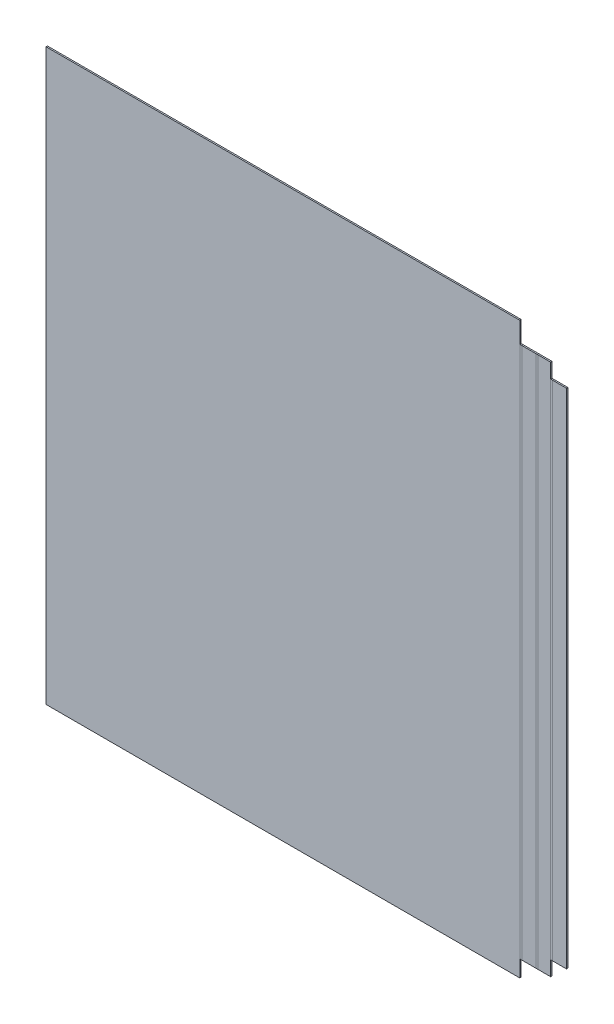
ISO-10303-21;
HEADER;
FILE_DESCRIPTION(('STEP AP214'),'2;1');
FILE_NAME('part.step','',(''),(''),'','','');
FILE_SCHEMA(('AUTOMOTIVE_DESIGN { 1 0 10303 214 1 1 1 1 }'));
ENDSEC;
DATA;
#1=APPLICATION_CONTEXT('core data for automotive mechanical design processes');
#2=APPLICATION_PROTOCOL_DEFINITION('international standard','automotive_design',2000,#1);
#3=PRODUCT_CONTEXT('',#1,'mechanical');
#4=PRODUCT('Part','Part','',(#3));
#5=PRODUCT_RELATED_PRODUCT_CATEGORY('part','',(#4));
#6=PRODUCT_DEFINITION_FORMATION('','',#4);
#7=PRODUCT_DEFINITION_CONTEXT('part definition',#1,'design');
#8=PRODUCT_DEFINITION('design','',#6,#7);
#9=PRODUCT_DEFINITION_SHAPE('','',#8);
#10=(LENGTH_UNIT() NAMED_UNIT(*) SI_UNIT(.MILLI.,.METRE.));
#11=(NAMED_UNIT(*) PLANE_ANGLE_UNIT() SI_UNIT($,.RADIAN.));
#12=(NAMED_UNIT(*) SI_UNIT($,.STERADIAN.) SOLID_ANGLE_UNIT());
#13=UNCERTAINTY_MEASURE_WITH_UNIT(LENGTH_MEASURE(1.E-05),#10,'distance_accuracy_value','');
#14=(GEOMETRIC_REPRESENTATION_CONTEXT(3) GLOBAL_UNCERTAINTY_ASSIGNED_CONTEXT((#13)) GLOBAL_UNIT_ASSIGNED_CONTEXT((#10,
#11,#12)) REPRESENTATION_CONTEXT('',''));
#15=CARTESIAN_POINT('',(0.,0.,0.));
#16=DIRECTION('',(0.,0.,1.));
#17=DIRECTION('',(1.,0.,0.));
#18=AXIS2_PLACEMENT_3D('',#15,#16,#17);
#19=CARTESIAN_POINT('',(343.802210169545,776.2,0.));
#20=DIRECTION('',(0.,0.,-1.));
#21=DIRECTION('',(-1.,0.,0.));
#22=AXIS2_PLACEMENT_3D('',#19,#20,#21);
#23=PLANE('',#22);
#24=DIRECTION('',(0.,-1.,0.));
#25=VECTOR('',#24,1.);
#26=CARTESIAN_POINT('',(363.065610169545,776.2,0.));
#27=LINE('',#26,#25);
#28=CARTESIAN_POINT('',(363.065610169545,747.8,0.));
#29=VERTEX_POINT('',#28);
#30=CARTESIAN_POINT('',(363.065610169545,22.5,0.));
#31=VERTEX_POINT('',#30);
#32=EDGE_CURVE('E392',#29,#31,#27,.T.);
#33=ORIENTED_EDGE('',*,*,#32,.T.);
#34=DIRECTION('',(-1.,0.,0.));
#35=VECTOR('',#34,1.);
#36=CARTESIAN_POINT('',(343.802210169545,22.5,0.));
#37=LINE('',#36,#35);
#38=CARTESIAN_POINT('',(346.438810169545,22.5,0.));
#39=VERTEX_POINT('',#38);
#40=EDGE_CURVE('E376',#31,#39,#37,.T.);
#41=ORIENTED_EDGE('',*,*,#40,.T.);
#42=DIRECTION('',(0.,-1.,0.));
#43=VECTOR('',#42,1.);
#44=CARTESIAN_POINT('',(346.438810169545,776.2,0.));
#45=LINE('',#44,#43);
#46=CARTESIAN_POINT('',(346.438810169545,747.8,0.));
#47=VERTEX_POINT('',#46);
#48=EDGE_CURVE('E382',#47,#39,#45,.T.);
#49=ORIENTED_EDGE('',*,*,#48,.F.);
#50=DIRECTION('',(-1.,0.,0.));
#51=VECTOR('',#50,1.);
#52=CARTESIAN_POINT('',(354.752210169545,747.8,0.));
#53=LINE('',#52,#51);
#54=EDGE_CURVE('E379',#29,#47,#53,.T.);
#55=ORIENTED_EDGE('',*,*,#54,.F.);
#56=EDGE_LOOP('',(#33,#41,#49,#55));
#57=FACE_BOUND('',#56,.T.);
#58=ADVANCED_FACE('F43',(#57),#23,.T.);
#59=CARTESIAN_POINT('',(343.802210169545,776.2,1.90000000000001));
#60=DIRECTION('',(0.,0.,-1.));
#61=DIRECTION('',(-1.,0.,0.));
#62=AXIS2_PLACEMENT_3D('',#59,#60,#61);
#63=PLANE('',#62);
#64=DIRECTION('',(1.,0.,0.));
#65=VECTOR('',#64,1.);
#66=CARTESIAN_POINT('',(354.752210169545,22.5,1.90000000000001));
#67=LINE('',#66,#65);
#68=CARTESIAN_POINT('',(363.065610169545,22.5,1.90000000000001));
#69=VERTEX_POINT('',#68);
#70=CARTESIAN_POINT('',(346.438810169545,22.5,1.90000000000001));
#71=VERTEX_POINT('',#70);
#72=EDGE_CURVE('E57',#69,#71,#67,.F.);
#73=ORIENTED_EDGE('',*,*,#72,.F.);
#74=DIRECTION('',(0.,-1.,0.));
#75=VECTOR('',#74,1.);
#76=CARTESIAN_POINT('',(363.065610169545,776.2,1.90000000000001));
#77=LINE('',#76,#75);
#78=CARTESIAN_POINT('',(363.065610169545,747.8,1.90000000000001));
#79=VERTEX_POINT('',#78);
#80=EDGE_CURVE('E50',#79,#69,#77,.T.);
#81=ORIENTED_EDGE('',*,*,#80,.F.);
#82=DIRECTION('',(-1.,0.,0.));
#83=VECTOR('',#82,1.);
#84=CARTESIAN_POINT('',(343.802210169545,747.8,1.90000000000001));
#85=LINE('',#84,#83);
#86=CARTESIAN_POINT('',(346.438810169545,747.8,1.90000000000001));
#87=VERTEX_POINT('',#86);
#88=EDGE_CURVE('E65',#79,#87,#85,.T.);
#89=ORIENTED_EDGE('',*,*,#88,.T.);
#90=DIRECTION('',(0.,-1.,0.));
#91=VECTOR('',#90,1.);
#92=CARTESIAN_POINT('',(346.438810169545,776.2,1.90000000000001));
#93=LINE('',#92,#91);
#94=EDGE_CURVE('E388',#87,#71,#93,.T.);
#95=ORIENTED_EDGE('',*,*,#94,.T.);
#96=EDGE_LOOP('',(#73,#81,#89,#95));
#97=FACE_BOUND('',#96,.T.);
#98=ADVANCED_FACE('F498',(#97),#63,.F.);
#99=CARTESIAN_POINT('',(343.802210169545,747.8,1.90000000000001));
#100=DIRECTION('',(0.,-1.,0.));
#101=DIRECTION('',(-1.,0.,0.));
#102=AXIS2_PLACEMENT_3D('',#99,#100,#101);
#103=PLANE('',#102);
#104=ORIENTED_EDGE('',*,*,#54,.T.);
#105=DIRECTION('',(0.,0.,1.));
#106=VECTOR('',#105,1.);
#107=CARTESIAN_POINT('',(346.438810169545,747.8,0.));
#108=LINE('',#107,#106);
#109=EDGE_CURVE('E390',#47,#87,#108,.T.);
#110=ORIENTED_EDGE('',*,*,#109,.T.);
#111=ORIENTED_EDGE('',*,*,#88,.F.);
#112=DIRECTION('',(0.,0.,1.));
#113=VECTOR('',#112,1.);
#114=CARTESIAN_POINT('',(363.065610169545,747.8,0.));
#115=LINE('',#114,#113);
#116=EDGE_CURVE('E394',#29,#79,#115,.T.);
#117=ORIENTED_EDGE('',*,*,#116,.F.);
#118=EDGE_LOOP('',(#104,#110,#111,#117));
#119=FACE_BOUND('',#118,.T.);
#120=ADVANCED_FACE('F429',(#119),#103,.F.);
#121=CARTESIAN_POINT('',(343.802210169545,22.5,0.));
#122=DIRECTION('',(0.,1.,0.));
#123=DIRECTION('',(-1.,0.,0.));
#124=AXIS2_PLACEMENT_3D('',#121,#122,#123);
#125=PLANE('',#124);
#126=DIRECTION('',(0.,0.,-1.));
#127=VECTOR('',#126,1.);
#128=CARTESIAN_POINT('',(363.065610169545,22.5,1.90000000000001));
#129=LINE('',#128,#127);
#130=EDGE_CURVE('E11',#69,#31,#129,.T.);
#131=ORIENTED_EDGE('',*,*,#130,.F.);
#132=ORIENTED_EDGE('',*,*,#72,.T.);
#133=DIRECTION('',(0.,0.,-1.));
#134=VECTOR('',#133,1.);
#135=CARTESIAN_POINT('',(346.438810169545,22.5,1.90000000000007));
#136=LINE('',#135,#134);
#137=EDGE_CURVE('E386',#71,#39,#136,.T.);
#138=ORIENTED_EDGE('',*,*,#137,.T.);
#139=ORIENTED_EDGE('',*,*,#40,.F.);
#140=EDGE_LOOP('',(#131,#132,#138,#139));
#141=FACE_BOUND('',#140,.T.);
#142=ADVANCED_FACE('F505',(#141),#125,.F.);
#143=CARTESIAN_POINT('',(304.7866,776.2,25.7366));
#144=DIRECTION('',(0.,-1.,0.));
#145=DIRECTION('',(-1.,0.,0.));
#146=AXIS2_PLACEMENT_3D('',#143,#144,#145);
#147=PLANE('',#146);
#148=DIRECTION('',(1.,0.,0.));
#149=VECTOR('',#148,1.);
#150=CARTESIAN_POINT('',(-324.05,776.2,1.9));
#151=LINE('',#150,#149);
#152=CARTESIAN_POINT('',(-324.05,776.2,1.9));
#153=VERTEX_POINT('',#152);
#154=CARTESIAN_POINT('',(321.4134,776.2,1.9));
#155=VERTEX_POINT('',#154);
#156=EDGE_CURVE('E365',#153,#155,#151,.T.);
#157=ORIENTED_EDGE('',*,*,#156,.T.);
#158=DIRECTION('',(0.,0.,-1.));
#159=VECTOR('',#158,1.);
#160=CARTESIAN_POINT('',(321.4134,776.2,1.9));
#161=LINE('',#160,#159);
#162=CARTESIAN_POINT('',(321.4134,776.2,0.));
#163=VERTEX_POINT('',#162);
#164=EDGE_CURVE('E362',#155,#163,#161,.T.);
#165=ORIENTED_EDGE('',*,*,#164,.T.);
#166=DIRECTION('',(1.,0.,0.));
#167=VECTOR('',#166,1.);
#168=CARTESIAN_POINT('',(-324.05,776.2,0.));
#169=LINE('',#168,#167);
#170=CARTESIAN_POINT('',(-324.05,776.2,0.));
#171=VERTEX_POINT('',#170);
#172=EDGE_CURVE('E333',#171,#163,#169,.T.);
#173=ORIENTED_EDGE('',*,*,#172,.F.);
#174=DIRECTION('',(0.,0.,-1.));
#175=VECTOR('',#174,1.);
#176=CARTESIAN_POINT('',(-324.05,776.2,1.9));
#177=LINE('',#176,#175);
#178=EDGE_CURVE('E359',#153,#171,#177,.T.);
#179=ORIENTED_EDGE('',*,*,#178,.F.);
#180=EDGE_LOOP('',(#157,#165,#173,#179));
#181=FACE_BOUND('',#180,.T.);
#182=ADVANCED_FACE('F510',(#181),#147,.F.);
#183=CARTESIAN_POINT('',(-324.05,776.2,1.9));
#184=DIRECTION('',(-1.,0.,0.));
#185=DIRECTION('',(0.,0.,1.));
#186=AXIS2_PLACEMENT_3D('',#183,#184,#185);
#187=PLANE('',#186);
#188=DIRECTION('',(0.,0.,-1.));
#189=VECTOR('',#188,1.);
#190=CARTESIAN_POINT('',(-324.05,0.,1.9));
#191=LINE('',#190,#189);
#192=CARTESIAN_POINT('',(-324.05,0.,1.9));
#193=VERTEX_POINT('',#192);
#194=CARTESIAN_POINT('',(-324.05,0.,0.));
#195=VERTEX_POINT('',#194);
#196=EDGE_CURVE('E348',#193,#195,#191,.T.);
#197=ORIENTED_EDGE('',*,*,#196,.F.);
#198=DIRECTION('',(0.,-1.,0.));
#199=VECTOR('',#198,1.);
#200=CARTESIAN_POINT('',(-324.05,776.2,1.9));
#201=LINE('',#200,#199);
#202=EDGE_CURVE('E338',#153,#193,#201,.T.);
#203=ORIENTED_EDGE('',*,*,#202,.F.);
#204=ORIENTED_EDGE('',*,*,#178,.T.);
#205=DIRECTION('',(0.,-1.,0.));
#206=VECTOR('',#205,1.);
#207=CARTESIAN_POINT('',(-324.05,776.2,0.));
#208=LINE('',#207,#206);
#209=EDGE_CURVE('E357',#171,#195,#208,.T.);
#210=ORIENTED_EDGE('',*,*,#209,.T.);
#211=EDGE_LOOP('',(#197,#203,#204,#210));
#212=FACE_BOUND('',#211,.T.);
#213=ADVANCED_FACE('F833',(#212),#187,.T.);
#214=CARTESIAN_POINT('',(322.15,0.,2.6366));
#215=DIRECTION('',(0.,-1.,0.));
#216=DIRECTION('',(0.,0.,-1.));
#217=AXIS2_PLACEMENT_3D('',#214,#215,#216);
#218=PLANE('',#217);
#219=DIRECTION('',(1.,0.,0.));
#220=VECTOR('',#219,1.);
#221=CARTESIAN_POINT('',(-324.05,0.,0.));
#222=LINE('',#221,#220);
#223=CARTESIAN_POINT('',(321.4134,0.,0.));
#224=VERTEX_POINT('',#223);
#225=EDGE_CURVE('E354',#195,#224,#222,.T.);
#226=ORIENTED_EDGE('',*,*,#225,.T.);
#227=DIRECTION('',(0.,0.,1.));
#228=VECTOR('',#227,1.);
#229=CARTESIAN_POINT('',(321.4134,0.,0.));
#230=LINE('',#229,#228);
#231=CARTESIAN_POINT('',(321.4134,0.,1.9));
#232=VERTEX_POINT('',#231);
#233=EDGE_CURVE('E351',#224,#232,#230,.T.);
#234=ORIENTED_EDGE('',*,*,#233,.T.);
#235=DIRECTION('',(1.,0.,0.));
#236=VECTOR('',#235,1.);
#237=CARTESIAN_POINT('',(-324.05,0.,1.9));
#238=LINE('',#237,#236);
#239=EDGE_CURVE('E340',#193,#232,#238,.T.);
#240=ORIENTED_EDGE('',*,*,#239,.F.);
#241=ORIENTED_EDGE('',*,*,#196,.T.);
#242=EDGE_LOOP('',(#226,#234,#240,#241));
#243=FACE_BOUND('',#242,.T.);
#244=ADVANCED_FACE('F822',(#243),#218,.T.);
#245=CARTESIAN_POINT('',(321.4134,762.,1.9));
#246=DIRECTION('',(1.,0.,0.));
#247=DIRECTION('',(0.,-1.,0.));
#248=AXIS2_PLACEMENT_3D('',#245,#246,#247);
#249=PLANE('',#248);
#250=ORIENTED_EDGE('',*,*,#164,.F.);
#251=DIRECTION('',(0.,-1.,0.));
#252=VECTOR('',#251,1.);
#253=CARTESIAN_POINT('',(321.4134,776.2,1.9));
#254=LINE('',#253,#252);
#255=CARTESIAN_POINT('',(321.4134,747.8,1.9));
#256=VERTEX_POINT('',#255);
#257=EDGE_CURVE('E346',#155,#256,#254,.T.);
#258=ORIENTED_EDGE('',*,*,#257,.T.);
#259=DIRECTION('',(0.,0.,-1.));
#260=VECTOR('',#259,1.);
#261=CARTESIAN_POINT('',(321.4134,747.8,1.9));
#262=LINE('',#261,#260);
#263=CARTESIAN_POINT('',(321.4134,747.8,0.));
#264=VERTEX_POINT('',#263);
#265=EDGE_CURVE('E343',#256,#264,#262,.T.);
#266=ORIENTED_EDGE('',*,*,#265,.T.);
#267=DIRECTION('',(0.,-1.,0.));
#268=VECTOR('',#267,1.);
#269=CARTESIAN_POINT('',(321.4134,776.2,0.));
#270=LINE('',#269,#268);
#271=EDGE_CURVE('E331',#163,#264,#270,.T.);
#272=ORIENTED_EDGE('',*,*,#271,.F.);
#273=EDGE_LOOP('',(#250,#258,#266,#272));
#274=FACE_BOUND('',#273,.T.);
#275=ADVANCED_FACE('F474',(#274),#249,.T.);
#276=CARTESIAN_POINT('',(-324.05,776.2,1.9));
#277=DIRECTION('',(0.,0.,-1.));
#278=DIRECTION('',(-1.,0.,0.));
#279=AXIS2_PLACEMENT_3D('',#276,#277,#278);
#280=PLANE('',#279);
#281=ORIENTED_EDGE('',*,*,#239,.T.);
#282=DIRECTION('',(0.,-1.,0.));
#283=VECTOR('',#282,1.);
#284=CARTESIAN_POINT('',(321.4134,776.2,1.9));
#285=LINE('',#284,#283);
#286=CARTESIAN_POINT('',(321.4134,22.5,1.9));
#287=VERTEX_POINT('',#286);
#288=EDGE_CURVE('E336',#287,#232,#285,.T.);
#289=ORIENTED_EDGE('',*,*,#288,.F.);
#290=DIRECTION('',(0.,-1.,0.));
#291=VECTOR('',#290,1.);
#292=CARTESIAN_POINT('',(321.4134,776.2,1.9));
#293=LINE('',#292,#291);
#294=EDGE_CURVE('E320',#256,#287,#293,.T.);
#295=ORIENTED_EDGE('',*,*,#294,.F.);
#296=ORIENTED_EDGE('',*,*,#257,.F.);
#297=ORIENTED_EDGE('',*,*,#156,.F.);
#298=ORIENTED_EDGE('',*,*,#202,.T.);
#299=EDGE_LOOP('',(#281,#289,#295,#296,#297,#298));
#300=FACE_BOUND('',#299,.T.);
#301=ADVANCED_FACE('F800',(#300),#280,.F.);
#302=CARTESIAN_POINT('',(321.4134,11.25,1.9));
#303=DIRECTION('',(1.,0.,0.));
#304=DIRECTION('',(0.,-1.,0.));
#305=AXIS2_PLACEMENT_3D('',#302,#303,#304);
#306=PLANE('',#305);
#307=ORIENTED_EDGE('',*,*,#288,.T.);
#308=ORIENTED_EDGE('',*,*,#233,.F.);
#309=DIRECTION('',(0.,-1.,0.));
#310=VECTOR('',#309,1.);
#311=CARTESIAN_POINT('',(321.4134,776.2,0.));
#312=LINE('',#311,#310);
#313=CARTESIAN_POINT('',(321.4134,22.5,0.));
#314=VERTEX_POINT('',#313);
#315=EDGE_CURVE('E326',#314,#224,#312,.T.);
#316=ORIENTED_EDGE('',*,*,#315,.F.);
#317=DIRECTION('',(0.,0.,-1.));
#318=VECTOR('',#317,1.);
#319=CARTESIAN_POINT('',(321.4134,22.5,1.9));
#320=LINE('',#319,#318);
#321=EDGE_CURVE('E311',#287,#314,#320,.T.);
#322=ORIENTED_EDGE('',*,*,#321,.F.);
#323=EDGE_LOOP('',(#307,#308,#316,#322));
#324=FACE_BOUND('',#323,.T.);
#325=ADVANCED_FACE('F486',(#324),#306,.T.);
#326=CARTESIAN_POINT('',(-324.05,776.2,0.));
#327=DIRECTION('',(0.,0.,-1.));
#328=DIRECTION('',(-1.,0.,0.));
#329=AXIS2_PLACEMENT_3D('',#326,#327,#328);
#330=PLANE('',#329);
#331=ORIENTED_EDGE('',*,*,#225,.F.);
#332=ORIENTED_EDGE('',*,*,#209,.F.);
#333=ORIENTED_EDGE('',*,*,#172,.T.);
#334=ORIENTED_EDGE('',*,*,#271,.T.);
#335=DIRECTION('',(0.,-1.,0.));
#336=VECTOR('',#335,1.);
#337=CARTESIAN_POINT('',(321.4134,776.2,0.));
#338=LINE('',#337,#336);
#339=EDGE_CURVE('E329',#264,#314,#338,.T.);
#340=ORIENTED_EDGE('',*,*,#339,.T.);
#341=ORIENTED_EDGE('',*,*,#315,.T.);
#342=EDGE_LOOP('',(#331,#332,#333,#334,#340,#341));
#343=FACE_BOUND('',#342,.T.);
#344=ADVANCED_FACE('F483',(#343),#330,.T.);
#345=CARTESIAN_POINT('',(321.4134,747.8,0.));
#346=DIRECTION('',(0.,1.,0.));
#347=DIRECTION('',(1.,0.,0.));
#348=AXIS2_PLACEMENT_3D('',#345,#346,#347);
#349=PLANE('',#348);
#350=DIRECTION('',(-1.,0.,0.));
#351=VECTOR('',#350,1.);
#352=CARTESIAN_POINT('',(322.738052542386,747.8,1.9));
#353=LINE('',#352,#351);
#354=CARTESIAN_POINT('',(324.062705084772,747.8,1.90000000000001));
#355=VERTEX_POINT('',#354);
#356=EDGE_CURVE('E323',#256,#355,#353,.F.);
#357=ORIENTED_EDGE('',*,*,#356,.T.);
#358=DIRECTION('',(0.,0.,1.));
#359=VECTOR('',#358,1.);
#360=CARTESIAN_POINT('',(324.062705084772,747.8,0.));
#361=LINE('',#360,#359);
#362=CARTESIAN_POINT('',(324.062705084772,747.8,0.));
#363=VERTEX_POINT('',#362);
#364=EDGE_CURVE('E285',#363,#355,#361,.T.);
#365=ORIENTED_EDGE('',*,*,#364,.F.);
#366=DIRECTION('',(1.,0.,0.));
#367=VECTOR('',#366,1.);
#368=CARTESIAN_POINT('',(321.4134,747.8,0.));
#369=LINE('',#368,#367);
#370=EDGE_CURVE('E308',#264,#363,#369,.T.);
#371=ORIENTED_EDGE('',*,*,#370,.F.);
#372=ORIENTED_EDGE('',*,*,#265,.F.);
#373=EDGE_LOOP('',(#357,#365,#371,#372));
#374=FACE_BOUND('',#373,.T.);
#375=ADVANCED_FACE('F471',(#374),#349,.T.);
#376=CARTESIAN_POINT('',(322.738052542386,385.15,1.9));
#377=DIRECTION('',(0.,0.,-1.));
#378=DIRECTION('',(-1.,0.,0.));
#379=AXIS2_PLACEMENT_3D('',#376,#377,#378);
#380=PLANE('',#379);
#381=ORIENTED_EDGE('',*,*,#294,.T.);
#382=DIRECTION('',(-1.,0.,0.));
#383=VECTOR('',#382,1.);
#384=CARTESIAN_POINT('',(322.738052542386,22.5,1.9));
#385=LINE('',#384,#383);
#386=CARTESIAN_POINT('',(324.062705084772,22.5,1.90000000000001));
#387=VERTEX_POINT('',#386);
#388=EDGE_CURVE('E314',#387,#287,#385,.T.);
#389=ORIENTED_EDGE('',*,*,#388,.F.);
#390=DIRECTION('',(0.,-1.,0.));
#391=VECTOR('',#390,1.);
#392=CARTESIAN_POINT('',(324.062705084772,776.2,1.90000000000001));
#393=LINE('',#392,#391);
#394=EDGE_CURVE('E290',#355,#387,#393,.T.);
#395=ORIENTED_EDGE('',*,*,#394,.F.);
#396=ORIENTED_EDGE('',*,*,#356,.F.);
#397=EDGE_LOOP('',(#381,#389,#395,#396));
#398=FACE_BOUND('',#397,.T.);
#399=ADVANCED_FACE('F469',(#398),#380,.F.);
#400=CARTESIAN_POINT('',(324.062705084772,22.5,0.));
#401=DIRECTION('',(0.,-1.,0.));
#402=DIRECTION('',(-1.,0.,0.));
#403=AXIS2_PLACEMENT_3D('',#400,#401,#402);
#404=PLANE('',#403);
#405=DIRECTION('',(0.,0.,1.));
#406=VECTOR('',#405,1.);
#407=CARTESIAN_POINT('',(324.062705084772,22.5,0.));
#408=LINE('',#407,#406);
#409=CARTESIAN_POINT('',(324.062705084772,22.5,0.));
#410=VERTEX_POINT('',#409);
#411=EDGE_CURVE('E317',#410,#387,#408,.T.);
#412=ORIENTED_EDGE('',*,*,#411,.T.);
#413=ORIENTED_EDGE('',*,*,#388,.T.);
#414=ORIENTED_EDGE('',*,*,#321,.T.);
#415=DIRECTION('',(-1.,0.,0.));
#416=VECTOR('',#415,1.);
#417=CARTESIAN_POINT('',(324.062705084772,22.5,0.));
#418=LINE('',#417,#416);
#419=EDGE_CURVE('E302',#410,#314,#418,.T.);
#420=ORIENTED_EDGE('',*,*,#419,.F.);
#421=EDGE_LOOP('',(#412,#413,#414,#420));
#422=FACE_BOUND('',#421,.T.);
#423=ADVANCED_FACE('F488',(#422),#404,.T.);
#424=CARTESIAN_POINT('',(322.738052542386,385.15,0.));
#425=DIRECTION('',(0.,0.,-1.));
#426=DIRECTION('',(-1.,0.,0.));
#427=AXIS2_PLACEMENT_3D('',#424,#425,#426);
#428=PLANE('',#427);
#429=ORIENTED_EDGE('',*,*,#339,.F.);
#430=ORIENTED_EDGE('',*,*,#370,.T.);
#431=DIRECTION('',(0.,-1.,0.));
#432=VECTOR('',#431,1.);
#433=CARTESIAN_POINT('',(324.062705084772,776.2,0.));
#434=LINE('',#433,#432);
#435=EDGE_CURVE('E305',#363,#410,#434,.T.);
#436=ORIENTED_EDGE('',*,*,#435,.T.);
#437=ORIENTED_EDGE('',*,*,#419,.T.);
#438=EDGE_LOOP('',(#429,#430,#436,#437));
#439=FACE_BOUND('',#438,.T.);
#440=ADVANCED_FACE('F478',(#439),#428,.T.);
#441=CARTESIAN_POINT('',(321.426105084772,776.2,0.));
#442=DIRECTION('',(0.,0.,-1.));
#443=DIRECTION('',(-1.,0.,0.));
#444=AXIS2_PLACEMENT_3D('',#441,#442,#443);
#445=PLANE('',#444);
#446=DIRECTION('',(0.,-1.,0.));
#447=VECTOR('',#446,1.);
#448=CARTESIAN_POINT('',(343.789505084772,776.2,0.));
#449=LINE('',#448,#447);
#450=CARTESIAN_POINT('',(343.789505084772,747.8,0.));
#451=VERTEX_POINT('',#450);
#452=CARTESIAN_POINT('',(343.789505084772,22.5,0.));
#453=VERTEX_POINT('',#452);
#454=EDGE_CURVE('E300',#451,#453,#449,.T.);
#455=ORIENTED_EDGE('',*,*,#454,.T.);
#456=DIRECTION('',(-1.,0.,0.));
#457=VECTOR('',#456,1.);
#458=CARTESIAN_POINT('',(321.426105084772,22.5,0.));
#459=LINE('',#458,#457);
#460=EDGE_CURVE('E297',#453,#410,#459,.T.);
#461=ORIENTED_EDGE('',*,*,#460,.T.);
#462=ORIENTED_EDGE('',*,*,#435,.F.);
#463=DIRECTION('',(-1.,0.,0.));
#464=VECTOR('',#463,1.);
#465=CARTESIAN_POINT('',(333.926105084772,747.8,0.));
#466=LINE('',#465,#464);
#467=EDGE_CURVE('E288',#451,#363,#466,.T.);
#468=ORIENTED_EDGE('',*,*,#467,.F.);
#469=EDGE_LOOP('',(#455,#461,#462,#468));
#470=FACE_BOUND('',#469,.T.);
#471=ADVANCED_FACE('F445',(#470),#445,.T.);
#472=CARTESIAN_POINT('',(321.426105084772,22.5,0.));
#473=DIRECTION('',(0.,1.,0.));
#474=DIRECTION('',(-1.,0.,0.));
#475=AXIS2_PLACEMENT_3D('',#472,#473,#474);
#476=PLANE('',#475);
#477=DIRECTION('',(0.,0.,-1.));
#478=VECTOR('',#477,1.);
#479=CARTESIAN_POINT('',(343.789505084772,22.5,1.90000000000001));
#480=LINE('',#479,#478);
#481=CARTESIAN_POINT('',(343.789505084772,22.5,1.90000000000001));
#482=VERTEX_POINT('',#481);
#483=EDGE_CURVE('E368',#482,#453,#480,.T.);
#484=ORIENTED_EDGE('',*,*,#483,.F.);
#485=DIRECTION('',(1.,0.,0.));
#486=VECTOR('',#485,1.);
#487=CARTESIAN_POINT('',(333.926105084772,22.5,1.90000000000001));
#488=LINE('',#487,#486);
#489=EDGE_CURVE('E295',#482,#387,#488,.F.);
#490=ORIENTED_EDGE('',*,*,#489,.T.);
#491=ORIENTED_EDGE('',*,*,#411,.F.);
#492=ORIENTED_EDGE('',*,*,#460,.F.);
#493=EDGE_LOOP('',(#484,#490,#491,#492));
#494=FACE_BOUND('',#493,.T.);
#495=ADVANCED_FACE('F450',(#494),#476,.F.);
#496=CARTESIAN_POINT('',(321.426105084772,776.2,1.90000000000001));
#497=DIRECTION('',(0.,0.,-1.));
#498=DIRECTION('',(-1.,0.,0.));
#499=AXIS2_PLACEMENT_3D('',#496,#497,#498);
#500=PLANE('',#499);
#501=ORIENTED_EDGE('',*,*,#489,.F.);
#502=DIRECTION('',(0.,-1.,0.));
#503=VECTOR('',#502,1.);
#504=CARTESIAN_POINT('',(343.789505084772,776.2,1.90000000000001));
#505=LINE('',#504,#503);
#506=CARTESIAN_POINT('',(343.789505084772,747.8,1.90000000000001));
#507=VERTEX_POINT('',#506);
#508=EDGE_CURVE('E371',#507,#482,#505,.T.);
#509=ORIENTED_EDGE('',*,*,#508,.F.);
#510=DIRECTION('',(-1.,0.,0.));
#511=VECTOR('',#510,1.);
#512=CARTESIAN_POINT('',(323.326105084772,747.8,1.90000000000001));
#513=LINE('',#512,#511);
#514=EDGE_CURVE('E293',#507,#355,#513,.T.);
#515=ORIENTED_EDGE('',*,*,#514,.T.);
#516=ORIENTED_EDGE('',*,*,#394,.T.);
#517=EDGE_LOOP('',(#501,#509,#515,#516));
#518=FACE_BOUND('',#517,.T.);
#519=ADVANCED_FACE('F459',(#518),#500,.F.);
#520=CARTESIAN_POINT('',(323.326105084772,747.8,1.90000000000001));
#521=DIRECTION('',(0.,-1.,0.));
#522=DIRECTION('',(-1.,0.,0.));
#523=AXIS2_PLACEMENT_3D('',#520,#521,#522);
#524=PLANE('',#523);
#525=ORIENTED_EDGE('',*,*,#467,.T.);
#526=ORIENTED_EDGE('',*,*,#364,.T.);
#527=ORIENTED_EDGE('',*,*,#514,.F.);
#528=DIRECTION('',(0.,0.,1.));
#529=VECTOR('',#528,1.);
#530=CARTESIAN_POINT('',(343.789505084772,747.8,0.));
#531=LINE('',#530,#529);
#532=EDGE_CURVE('E280',#451,#507,#531,.T.);
#533=ORIENTED_EDGE('',*,*,#532,.F.);
#534=EDGE_LOOP('',(#525,#526,#527,#533));
#535=FACE_BOUND('',#534,.T.);
#536=ADVANCED_FACE('F461',(#535),#524,.F.);
#537=CARTESIAN_POINT('',(346.438810169545,22.5,0.));
#538=DIRECTION('',(0.,-1.,0.));
#539=DIRECTION('',(-1.,0.,0.));
#540=AXIS2_PLACEMENT_3D('',#537,#538,#539);
#541=PLANE('',#540);
#542=ORIENTED_EDGE('',*,*,#137,.F.);
#543=DIRECTION('',(-1.,0.,0.));
#544=VECTOR('',#543,1.);
#545=CARTESIAN_POINT('',(345.114157627158,22.5,1.9));
#546=LINE('',#545,#544);
#547=EDGE_CURVE('E272',#71,#482,#546,.T.);
#548=ORIENTED_EDGE('',*,*,#547,.T.);
#549=ORIENTED_EDGE('',*,*,#483,.T.);
#550=DIRECTION('',(-1.,0.,0.));
#551=VECTOR('',#550,1.);
#552=CARTESIAN_POINT('',(346.438810169545,22.5,0.));
#553=LINE('',#552,#551);
#554=EDGE_CURVE('E273',#39,#453,#553,.T.);
#555=ORIENTED_EDGE('',*,*,#554,.F.);
#556=EDGE_LOOP('',(#542,#548,#549,#555));
#557=FACE_BOUND('',#556,.T.);
#558=ADVANCED_FACE('F453',(#557),#541,.T.);
#559=CARTESIAN_POINT('',(343.789505084772,747.8,0.));
#560=DIRECTION('',(0.,1.,0.));
#561=DIRECTION('',(1.,0.,0.));
#562=AXIS2_PLACEMENT_3D('',#559,#560,#561);
#563=PLANE('',#562);
#564=DIRECTION('',(-1.,0.,0.));
#565=VECTOR('',#564,1.);
#566=CARTESIAN_POINT('',(345.114157627158,747.8,1.9));
#567=LINE('',#566,#565);
#568=EDGE_CURVE('E277',#507,#87,#567,.F.);
#569=ORIENTED_EDGE('',*,*,#568,.T.);
#570=ORIENTED_EDGE('',*,*,#109,.F.);
#571=DIRECTION('',(1.,0.,0.));
#572=VECTOR('',#571,1.);
#573=CARTESIAN_POINT('',(343.789505084772,747.8,0.));
#574=LINE('',#573,#572);
#575=EDGE_CURVE('E276',#451,#47,#574,.T.);
#576=ORIENTED_EDGE('',*,*,#575,.F.);
#577=ORIENTED_EDGE('',*,*,#532,.T.);
#578=EDGE_LOOP('',(#569,#570,#576,#577));
#579=FACE_BOUND('',#578,.T.);
#580=ADVANCED_FACE('F439',(#579),#563,.T.);
#581=CARTESIAN_POINT('',(345.114157627158,385.15,0.));
#582=DIRECTION('',(0.,0.,-1.));
#583=DIRECTION('',(-1.,0.,0.));
#584=AXIS2_PLACEMENT_3D('',#581,#582,#583);
#585=PLANE('',#584);
#586=ORIENTED_EDGE('',*,*,#454,.F.);
#587=ORIENTED_EDGE('',*,*,#575,.T.);
#588=ORIENTED_EDGE('',*,*,#48,.T.);
#589=ORIENTED_EDGE('',*,*,#554,.T.);
#590=EDGE_LOOP('',(#586,#587,#588,#589));
#591=FACE_BOUND('',#590,.T.);
#592=ADVANCED_FACE('F442',(#591),#585,.T.);
#593=CARTESIAN_POINT('',(345.114157627158,385.15,1.9));
#594=DIRECTION('',(0.,0.,-1.));
#595=DIRECTION('',(-1.,0.,0.));
#596=AXIS2_PLACEMENT_3D('',#593,#594,#595);
#597=PLANE('',#596);
#598=ORIENTED_EDGE('',*,*,#508,.T.);
#599=ORIENTED_EDGE('',*,*,#547,.F.);
#600=ORIENTED_EDGE('',*,*,#94,.F.);
#601=ORIENTED_EDGE('',*,*,#568,.F.);
#602=EDGE_LOOP('',(#598,#599,#600,#601));
#603=FACE_BOUND('',#602,.T.);
#604=ADVANCED_FACE('F456',(#603),#597,.F.);
#605=CARTESIAN_POINT('',(363.543159288139,747.8,0.));
#606=DIRECTION('',(1.,0.,0.));
#607=DIRECTION('',(0.,-1.,0.));
#608=AXIS2_PLACEMENT_3D('',#605,#606,#607);
#609=PLANE('',#608);
#610=DIRECTION('',(0.,0.,-1.));
#611=VECTOR('',#610,1.);
#612=CARTESIAN_POINT('',(363.543159288139,747.8,0.));
#613=LINE('',#612,#611);
#614=CARTESIAN_POINT('',(363.543159288139,747.8,1.9));
#615=VERTEX_POINT('',#614);
#616=CARTESIAN_POINT('',(363.543159288139,747.8,0.));
#617=VERTEX_POINT('',#616);
#618=EDGE_CURVE('E270',#615,#617,#613,.T.);
#619=ORIENTED_EDGE('',*,*,#618,.F.);
#620=DIRECTION('',(0.,1.,0.));
#621=VECTOR('',#620,1.);
#622=CARTESIAN_POINT('',(363.543159288139,385.15,1.9));
#623=LINE('',#622,#621);
#624=CARTESIAN_POINT('',(363.543159288139,727.8,1.9));
#625=VERTEX_POINT('',#624);
#626=EDGE_CURVE('E202',#615,#625,#623,.F.);
#627=ORIENTED_EDGE('',*,*,#626,.T.);
#628=DIRECTION('',(0.,0.,-1.));
#629=VECTOR('',#628,1.);
#630=CARTESIAN_POINT('',(363.543159288139,727.8,0.));
#631=LINE('',#630,#629);
#632=CARTESIAN_POINT('',(363.543159288139,727.8,0.));
#633=VERTEX_POINT('',#632);
#634=EDGE_CURVE('E268',#625,#633,#631,.T.);
#635=ORIENTED_EDGE('',*,*,#634,.T.);
#636=DIRECTION('',(0.,-1.,0.));
#637=VECTOR('',#636,1.);
#638=CARTESIAN_POINT('',(363.543159288139,747.8,0.));
#639=LINE('',#638,#637);
#640=EDGE_CURVE('E229',#617,#633,#639,.T.);
#641=ORIENTED_EDGE('',*,*,#640,.F.);
#642=EDGE_LOOP('',(#619,#627,#635,#641));
#643=FACE_BOUND('',#642,.T.);
#644=ADVANCED_FACE('F425',(#643),#609,.T.);
#645=CARTESIAN_POINT('',(365.714915254317,727.8,0.));
#646=DIRECTION('',(0.,1.,0.));
#647=DIRECTION('',(1.,0.,0.));
#648=AXIS2_PLACEMENT_3D('',#645,#646,#647);
#649=PLANE('',#648);
#650=ORIENTED_EDGE('',*,*,#634,.F.);
#651=DIRECTION('',(-1.,0.,0.));
#652=VECTOR('',#651,1.);
#653=CARTESIAN_POINT('',(364.390262711931,727.8,1.9));
#654=LINE('',#653,#652);
#655=CARTESIAN_POINT('',(365.714915254317,727.8,1.90000000000001));
#656=VERTEX_POINT('',#655);
#657=EDGE_CURVE('E258',#625,#656,#654,.F.);
#658=ORIENTED_EDGE('',*,*,#657,.T.);
#659=DIRECTION('',(0.,0.,-1.));
#660=VECTOR('',#659,1.);
#661=CARTESIAN_POINT('',(365.714915254317,727.8,1.90000000000001));
#662=LINE('',#661,#660);
#663=CARTESIAN_POINT('',(365.714915254317,727.8,0.));
#664=VERTEX_POINT('',#663);
#665=EDGE_CURVE('E217',#656,#664,#662,.T.);
#666=ORIENTED_EDGE('',*,*,#665,.T.);
#667=DIRECTION('',(1.,0.,0.));
#668=VECTOR('',#667,1.);
#669=CARTESIAN_POINT('',(365.714915254317,727.8,0.));
#670=LINE('',#669,#668);
#671=EDGE_CURVE('E232',#633,#664,#670,.T.);
#672=ORIENTED_EDGE('',*,*,#671,.F.);
#673=EDGE_LOOP('',(#650,#658,#666,#672));
#674=FACE_BOUND('',#673,.T.);
#675=ADVANCED_FACE('F420',(#674),#649,.T.);
#676=CARTESIAN_POINT('',(363.543159288139,42.5,0.));
#677=DIRECTION('',(0.,-1.,0.));
#678=DIRECTION('',(-1.,0.,0.));
#679=AXIS2_PLACEMENT_3D('',#676,#677,#678);
#680=PLANE('',#679);
#681=DIRECTION('',(0.,0.,-1.));
#682=VECTOR('',#681,1.);
#683=CARTESIAN_POINT('',(365.714915254317,42.5,1.90000000000001));
#684=LINE('',#683,#682);
#685=CARTESIAN_POINT('',(365.714915254317,42.5,1.90000000000001));
#686=VERTEX_POINT('',#685);
#687=CARTESIAN_POINT('',(365.714915254317,42.5,0.));
#688=VERTEX_POINT('',#687);
#689=EDGE_CURVE('E211',#686,#688,#684,.T.);
#690=ORIENTED_EDGE('',*,*,#689,.F.);
#691=DIRECTION('',(-1.,0.,0.));
#692=VECTOR('',#691,1.);
#693=CARTESIAN_POINT('',(364.390262711931,42.5,1.9));
#694=LINE('',#693,#692);
#695=CARTESIAN_POINT('',(363.543159288139,42.5,1.9));
#696=VERTEX_POINT('',#695);
#697=EDGE_CURVE('E255',#686,#696,#694,.T.);
#698=ORIENTED_EDGE('',*,*,#697,.T.);
#699=DIRECTION('',(0.,0.,-1.));
#700=VECTOR('',#699,1.);
#701=CARTESIAN_POINT('',(363.543159288139,42.5,0.));
#702=LINE('',#701,#700);
#703=CARTESIAN_POINT('',(363.543159288139,42.5,0.));
#704=VERTEX_POINT('',#703);
#705=EDGE_CURVE('E266',#696,#704,#702,.T.);
#706=ORIENTED_EDGE('',*,*,#705,.T.);
#707=DIRECTION('',(-1.,0.,0.));
#708=VECTOR('',#707,1.);
#709=CARTESIAN_POINT('',(363.543159288139,42.5,0.));
#710=LINE('',#709,#708);
#711=EDGE_CURVE('E236',#688,#704,#710,.T.);
#712=ORIENTED_EDGE('',*,*,#711,.F.);
#713=EDGE_LOOP('',(#690,#698,#706,#712));
#714=FACE_BOUND('',#713,.T.);
#715=ADVANCED_FACE('F415',(#714),#680,.T.);
#716=CARTESIAN_POINT('',(363.543159288139,22.5,0.));
#717=DIRECTION('',(1.,0.,0.));
#718=DIRECTION('',(0.,-1.,0.));
#719=AXIS2_PLACEMENT_3D('',#716,#717,#718);
#720=PLANE('',#719);
#721=ORIENTED_EDGE('',*,*,#705,.F.);
#722=DIRECTION('',(0.,1.,0.));
#723=VECTOR('',#722,1.);
#724=CARTESIAN_POINT('',(363.543159288139,385.15,1.9));
#725=LINE('',#724,#723);
#726=CARTESIAN_POINT('',(363.543159288139,22.5,1.9));
#727=VERTEX_POINT('',#726);
#728=EDGE_CURVE('E252',#696,#727,#725,.F.);
#729=ORIENTED_EDGE('',*,*,#728,.T.);
#730=DIRECTION('',(0.,0.,-1.));
#731=VECTOR('',#730,1.);
#732=CARTESIAN_POINT('',(363.543159288139,22.5,0.));
#733=LINE('',#732,#731);
#734=CARTESIAN_POINT('',(363.543159288139,22.5,0.));
#735=VERTEX_POINT('',#734);
#736=EDGE_CURVE('E248',#727,#735,#733,.T.);
#737=ORIENTED_EDGE('',*,*,#736,.T.);
#738=DIRECTION('',(0.,-1.,0.));
#739=VECTOR('',#738,1.);
#740=CARTESIAN_POINT('',(363.543159288139,22.5,0.));
#741=LINE('',#740,#739);
#742=EDGE_CURVE('E239',#704,#735,#741,.T.);
#743=ORIENTED_EDGE('',*,*,#742,.F.);
#744=EDGE_LOOP('',(#721,#729,#737,#743));
#745=FACE_BOUND('',#744,.T.);
#746=ADVANCED_FACE('F408',(#745),#720,.T.);
#747=CARTESIAN_POINT('',(363.065610169545,22.5,0.));
#748=DIRECTION('',(0.,-1.,0.));
#749=DIRECTION('',(-1.,0.,0.));
#750=AXIS2_PLACEMENT_3D('',#747,#748,#749);
#751=PLANE('',#750);
#752=ORIENTED_EDGE('',*,*,#736,.F.);
#753=DIRECTION('',(-1.,0.,0.));
#754=VECTOR('',#753,1.);
#755=CARTESIAN_POINT('',(364.390262711931,22.5,1.9));
#756=LINE('',#755,#754);
#757=EDGE_CURVE('E249',#727,#69,#756,.T.);
#758=ORIENTED_EDGE('',*,*,#757,.T.);
#759=ORIENTED_EDGE('',*,*,#130,.T.);
#760=DIRECTION('',(-1.,0.,0.));
#761=VECTOR('',#760,1.);
#762=CARTESIAN_POINT('',(363.065610169545,22.5,0.));
#763=LINE('',#762,#761);
#764=EDGE_CURVE('E242',#735,#31,#763,.T.);
#765=ORIENTED_EDGE('',*,*,#764,.F.);
#766=EDGE_LOOP('',(#752,#758,#759,#765));
#767=FACE_BOUND('',#766,.T.);
#768=ADVANCED_FACE('F404',(#767),#751,.T.);
#769=CARTESIAN_POINT('',(363.065610169545,747.8,0.));
#770=DIRECTION('',(0.,1.,0.));
#771=DIRECTION('',(1.,0.,0.));
#772=AXIS2_PLACEMENT_3D('',#769,#770,#771);
#773=PLANE('',#772);
#774=DIRECTION('',(-1.,0.,0.));
#775=VECTOR('',#774,1.);
#776=CARTESIAN_POINT('',(364.390262711931,747.8,1.9));
#777=LINE('',#776,#775);
#778=EDGE_CURVE('E233',#79,#615,#777,.F.);
#779=ORIENTED_EDGE('',*,*,#778,.T.);
#780=ORIENTED_EDGE('',*,*,#618,.T.);
#781=DIRECTION('',(1.,0.,0.));
#782=VECTOR('',#781,1.);
#783=CARTESIAN_POINT('',(363.065610169545,747.8,0.));
#784=LINE('',#783,#782);
#785=EDGE_CURVE('E245',#29,#617,#784,.T.);
#786=ORIENTED_EDGE('',*,*,#785,.F.);
#787=ORIENTED_EDGE('',*,*,#116,.T.);
#788=EDGE_LOOP('',(#779,#780,#786,#787));
#789=FACE_BOUND('',#788,.T.);
#790=ADVANCED_FACE('F428',(#789),#773,.T.);
#791=CARTESIAN_POINT('',(364.390262711931,385.15,0.));
#792=DIRECTION('',(0.,0.,-1.));
#793=DIRECTION('',(-1.,0.,0.));
#794=AXIS2_PLACEMENT_3D('',#791,#792,#793);
#795=PLANE('',#794);
#796=ORIENTED_EDGE('',*,*,#32,.F.);
#797=ORIENTED_EDGE('',*,*,#785,.T.);
#798=ORIENTED_EDGE('',*,*,#640,.T.);
#799=ORIENTED_EDGE('',*,*,#671,.T.);
#800=DIRECTION('',(0.,-1.,0.));
#801=VECTOR('',#800,1.);
#802=CARTESIAN_POINT('',(365.714915254317,776.2,0.));
#803=LINE('',#802,#801);
#804=EDGE_CURVE('E223',#664,#688,#803,.T.);
#805=ORIENTED_EDGE('',*,*,#804,.T.);
#806=ORIENTED_EDGE('',*,*,#711,.T.);
#807=ORIENTED_EDGE('',*,*,#742,.T.);
#808=ORIENTED_EDGE('',*,*,#764,.T.);
#809=EDGE_LOOP('',(#796,#797,#798,#799,#805,#806,#807,#808));
#810=FACE_BOUND('',#809,.T.);
#811=ADVANCED_FACE('F411',(#810),#795,.T.);
#812=CARTESIAN_POINT('',(364.390262711931,385.15,1.9));
#813=DIRECTION('',(0.,0.,-1.));
#814=DIRECTION('',(-1.,0.,0.));
#815=AXIS2_PLACEMENT_3D('',#812,#813,#814);
#816=PLANE('',#815);
#817=ORIENTED_EDGE('',*,*,#80,.T.);
#818=ORIENTED_EDGE('',*,*,#757,.F.);
#819=ORIENTED_EDGE('',*,*,#728,.F.);
#820=ORIENTED_EDGE('',*,*,#697,.F.);
#821=DIRECTION('',(0.,-1.,0.));
#822=VECTOR('',#821,1.);
#823=CARTESIAN_POINT('',(365.714915254317,776.2,1.90000000000001));
#824=LINE('',#823,#822);
#825=EDGE_CURVE('E209',#656,#686,#824,.T.);
#826=ORIENTED_EDGE('',*,*,#825,.F.);
#827=ORIENTED_EDGE('',*,*,#657,.F.);
#828=ORIENTED_EDGE('',*,*,#626,.F.);
#829=ORIENTED_EDGE('',*,*,#778,.F.);
#830=EDGE_LOOP('',(#817,#818,#819,#820,#826,#827,#828,#829));
#831=FACE_BOUND('',#830,.T.);
#832=ADVANCED_FACE('F400',(#831),#816,.F.);
#833=CARTESIAN_POINT('',(384.978315254317,776.2,0.));
#834=DIRECTION('',(1.,0.,0.));
#835=DIRECTION('',(0.,0.,-1.));
#836=AXIS2_PLACEMENT_3D('',#833,#834,#835);
#837=PLANE('',#836);
#838=DIRECTION('',(0.,-1.,0.));
#839=VECTOR('',#838,1.);
#840=CARTESIAN_POINT('',(384.978315254317,776.2,0.));
#841=LINE('',#840,#839);
#842=CARTESIAN_POINT('',(384.978315254317,727.8,0.));
#843=VERTEX_POINT('',#842);
#844=CARTESIAN_POINT('',(384.978315254317,42.5,0.));
#845=VERTEX_POINT('',#844);
#846=EDGE_CURVE('E220',#843,#845,#841,.T.);
#847=ORIENTED_EDGE('',*,*,#846,.F.);
#848=DIRECTION('',(0.,0.,1.));
#849=VECTOR('',#848,1.);
#850=CARTESIAN_POINT('',(384.978315254317,727.8,0.));
#851=LINE('',#850,#849);
#852=CARTESIAN_POINT('',(384.978315254317,727.8,1.90000000000001));
#853=VERTEX_POINT('',#852);
#854=EDGE_CURVE('E215',#853,#843,#851,.F.);
#855=ORIENTED_EDGE('',*,*,#854,.F.);
#856=DIRECTION('',(0.,-1.,0.));
#857=VECTOR('',#856,1.);
#858=CARTESIAN_POINT('',(384.978315254317,776.2,1.90000000000001));
#859=LINE('',#858,#857);
#860=CARTESIAN_POINT('',(384.978315254317,42.5,1.90000000000001));
#861=VERTEX_POINT('',#860);
#862=EDGE_CURVE('E207',#853,#861,#859,.T.);
#863=ORIENTED_EDGE('',*,*,#862,.T.);
#864=DIRECTION('',(0.,0.,-1.));
#865=VECTOR('',#864,1.);
#866=CARTESIAN_POINT('',(384.978315254317,42.5,1.90000000000001));
#867=LINE('',#866,#865);
#868=EDGE_CURVE('E191',#845,#861,#867,.F.);
#869=ORIENTED_EDGE('',*,*,#868,.F.);
#870=EDGE_LOOP('',(#847,#855,#863,#869));
#871=FACE_BOUND('',#870,.T.);
#872=ADVANCED_FACE('F214',(#871),#837,.T.);
#873=CARTESIAN_POINT('',(364.978315254317,776.2,0.));
#874=DIRECTION('',(0.,0.,-1.));
#875=DIRECTION('',(-1.,0.,0.));
#876=AXIS2_PLACEMENT_3D('',#873,#874,#875);
#877=PLANE('',#876);
#878=ORIENTED_EDGE('',*,*,#804,.F.);
#879=DIRECTION('',(1.,0.,0.));
#880=VECTOR('',#879,1.);
#881=CARTESIAN_POINT('',(364.978315254317,727.8,0.));
#882=LINE('',#881,#880);
#883=EDGE_CURVE('E216',#664,#843,#882,.T.);
#884=ORIENTED_EDGE('',*,*,#883,.T.);
#885=ORIENTED_EDGE('',*,*,#846,.T.);
#886=DIRECTION('',(-1.,0.,0.));
#887=VECTOR('',#886,1.);
#888=CARTESIAN_POINT('',(375.346615254317,42.5,0.));
#889=LINE('',#888,#887);
#890=EDGE_CURVE('E197',#688,#845,#889,.F.);
#891=ORIENTED_EDGE('',*,*,#890,.F.);
#892=EDGE_LOOP('',(#878,#884,#885,#891));
#893=FACE_BOUND('',#892,.T.);
#894=ADVANCED_FACE('F641',(#893),#877,.T.);
#895=CARTESIAN_POINT('',(364.978315254317,727.8,0.));
#896=DIRECTION('',(0.,-1.,0.));
#897=DIRECTION('',(1.,0.,0.));
#898=AXIS2_PLACEMENT_3D('',#895,#896,#897);
#899=PLANE('',#898);
#900=ORIENTED_EDGE('',*,*,#665,.F.);
#901=DIRECTION('',(1.,0.,0.));
#902=VECTOR('',#901,1.);
#903=CARTESIAN_POINT('',(375.346615254317,727.8,1.90000000000001));
#904=LINE('',#903,#902);
#905=EDGE_CURVE('E921',#656,#853,#904,.T.);
#906=ORIENTED_EDGE('',*,*,#905,.T.);
#907=ORIENTED_EDGE('',*,*,#854,.T.);
#908=ORIENTED_EDGE('',*,*,#883,.F.);
#909=EDGE_LOOP('',(#900,#906,#907,#908));
#910=FACE_BOUND('',#909,.T.);
#911=ADVANCED_FACE('F648',(#910),#899,.F.);
#912=CARTESIAN_POINT('',(364.978315254317,776.2,1.90000000000001));
#913=DIRECTION('',(0.,0.,-1.));
#914=DIRECTION('',(-1.,0.,0.));
#915=AXIS2_PLACEMENT_3D('',#912,#913,#914);
#916=PLANE('',#915);
#917=ORIENTED_EDGE('',*,*,#905,.F.);
#918=ORIENTED_EDGE('',*,*,#825,.T.);
#919=DIRECTION('',(1.,0.,0.));
#920=VECTOR('',#919,1.);
#921=CARTESIAN_POINT('',(362.341715254317,42.5,1.90000000000001));
#922=LINE('',#921,#920);
#923=EDGE_CURVE('E194',#686,#861,#922,.T.);
#924=ORIENTED_EDGE('',*,*,#923,.T.);
#925=ORIENTED_EDGE('',*,*,#862,.F.);
#926=EDGE_LOOP('',(#917,#918,#924,#925));
#927=FACE_BOUND('',#926,.T.);
#928=ADVANCED_FACE('F206',(#927),#916,.F.);
#929=CARTESIAN_POINT('',(362.341715254317,42.5,1.90000000000001));
#930=DIRECTION('',(0.,1.,0.));
#931=DIRECTION('',(1.,0.,0.));
#932=AXIS2_PLACEMENT_3D('',#929,#930,#931);
#933=PLANE('',#932);
#934=ORIENTED_EDGE('',*,*,#689,.T.);
#935=ORIENTED_EDGE('',*,*,#890,.T.);
#936=ORIENTED_EDGE('',*,*,#868,.T.);
#937=ORIENTED_EDGE('',*,*,#923,.F.);
#938=EDGE_LOOP('',(#934,#935,#936,#937));
#939=FACE_BOUND('',#938,.T.);
#940=ADVANCED_FACE('F193',(#939),#933,.F.);
#941=CLOSED_SHELL('',(#58,#98,#120,#142,#182,#213,#244,#275,#301,#325,#344,#375,#399,#423,#440,
#471,#495,#519,#536,#558,#580,#592,#604,#644,#675,#715,#746,#768,#790,#811,#832,#872,#894,#911,
#928,#940));
#942=MANIFOLD_SOLID_BREP('B2',#941);
#943=ADVANCED_BREP_SHAPE_REPRESENTATION('',(#18,#942),#14);
#944=SHAPE_DEFINITION_REPRESENTATION(#9,#943);
ENDSEC;
END-ISO-10303-21;
